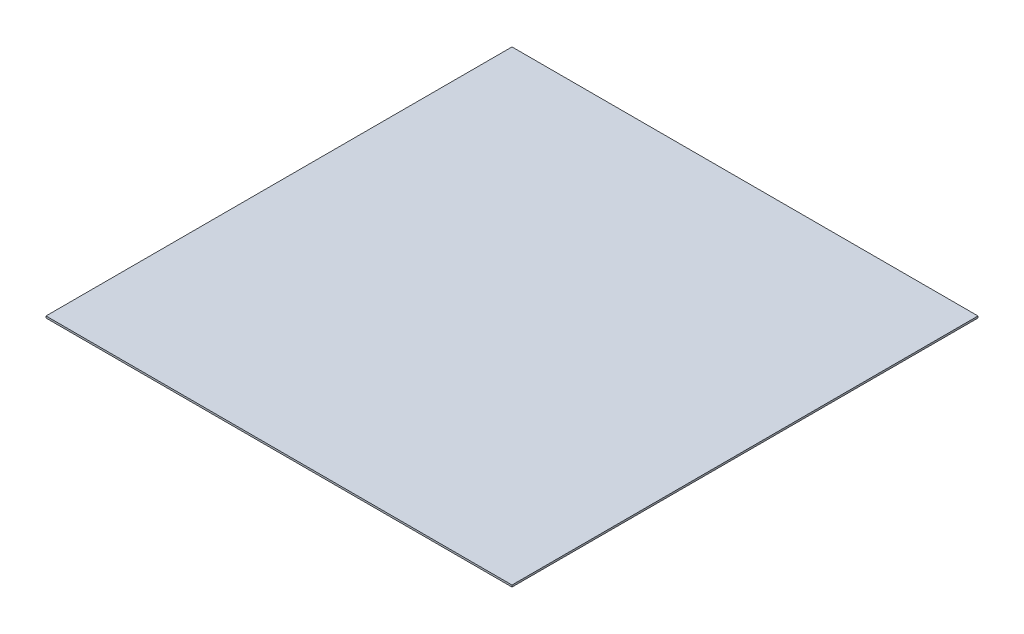
ISO-10303-21;
HEADER;
FILE_DESCRIPTION(('STEP AP214'),'2;1');
FILE_NAME('part.step','',(''),(''),'','','');
FILE_SCHEMA(('AUTOMOTIVE_DESIGN { 1 0 10303 214 1 1 1 1 }'));
ENDSEC;
DATA;
#1=APPLICATION_CONTEXT('core data for automotive mechanical design processes');
#2=APPLICATION_PROTOCOL_DEFINITION('international standard','automotive_design',2000,#1);
#3=PRODUCT_CONTEXT('',#1,'mechanical');
#4=PRODUCT('Part','Part','',(#3));
#5=PRODUCT_RELATED_PRODUCT_CATEGORY('part','',(#4));
#6=PRODUCT_DEFINITION_FORMATION('','',#4);
#7=PRODUCT_DEFINITION_CONTEXT('part definition',#1,'design');
#8=PRODUCT_DEFINITION('design','',#6,#7);
#9=PRODUCT_DEFINITION_SHAPE('','',#8);
#10=(LENGTH_UNIT() NAMED_UNIT(*) SI_UNIT(.MILLI.,.METRE.));
#11=(NAMED_UNIT(*) PLANE_ANGLE_UNIT() SI_UNIT($,.RADIAN.));
#12=(NAMED_UNIT(*) SI_UNIT($,.STERADIAN.) SOLID_ANGLE_UNIT());
#13=UNCERTAINTY_MEASURE_WITH_UNIT(LENGTH_MEASURE(1.E-05),#10,'distance_accuracy_value','');
#14=(GEOMETRIC_REPRESENTATION_CONTEXT(3) GLOBAL_UNCERTAINTY_ASSIGNED_CONTEXT((#13)) GLOBAL_UNIT_ASSIGNED_CONTEXT((#10,
#11,#12)) REPRESENTATION_CONTEXT('',''));
#15=CARTESIAN_POINT('',(0.,0.,0.));
#16=DIRECTION('',(0.,0.,1.));
#17=DIRECTION('',(1.,0.,0.));
#18=AXIS2_PLACEMENT_3D('',#15,#16,#17);
#19=CARTESIAN_POINT('',(255.,2.,255.));
#20=DIRECTION('',(-1.,0.,0.));
#21=DIRECTION('',(0.,0.,1.));
#22=AXIS2_PLACEMENT_3D('',#19,#20,#21);
#23=PLANE('',#22);
#24=DIRECTION('',(0.,0.,-1.));
#25=VECTOR('',#24,1.);
#26=CARTESIAN_POINT('',(255.,0.,255.));
#27=LINE('',#26,#25);
#28=CARTESIAN_POINT('',(255.,0.,255.));
#29=VERTEX_POINT('',#28);
#30=CARTESIAN_POINT('',(255.,0.,-255.));
#31=VERTEX_POINT('',#30);
#32=EDGE_CURVE('E96',#29,#31,#27,.T.);
#33=ORIENTED_EDGE('',*,*,#32,.T.);
#34=DIRECTION('',(0.,-1.,0.));
#35=VECTOR('',#34,1.);
#36=CARTESIAN_POINT('',(255.,2.,-255.));
#37=LINE('',#36,#35);
#38=CARTESIAN_POINT('',(255.,2.,-255.));
#39=VERTEX_POINT('',#38);
#40=EDGE_CURVE('E11',#39,#31,#37,.T.);
#41=ORIENTED_EDGE('',*,*,#40,.F.);
#42=DIRECTION('',(0.,0.,-1.));
#43=VECTOR('',#42,1.);
#44=CARTESIAN_POINT('',(255.,2.,255.));
#45=LINE('',#44,#43);
#46=CARTESIAN_POINT('',(255.,2.,255.));
#47=VERTEX_POINT('',#46);
#48=EDGE_CURVE('E84',#47,#39,#45,.T.);
#49=ORIENTED_EDGE('',*,*,#48,.F.);
#50=DIRECTION('',(0.,-1.,0.));
#51=VECTOR('',#50,1.);
#52=CARTESIAN_POINT('',(255.,2.,255.));
#53=LINE('',#52,#51);
#54=EDGE_CURVE('E92',#47,#29,#53,.T.);
#55=ORIENTED_EDGE('',*,*,#54,.T.);
#56=EDGE_LOOP('',(#33,#41,#49,#55));
#57=FACE_BOUND('',#56,.T.);
#58=ADVANCED_FACE('F33',(#57),#23,.F.);
#59=CARTESIAN_POINT('',(-255.,2.,-255.));
#60=DIRECTION('',(0.,0.,1.));
#61=DIRECTION('',(1.,0.,0.));
#62=AXIS2_PLACEMENT_3D('',#59,#60,#61);
#63=PLANE('',#62);
#64=DIRECTION('',(-1.,0.,0.));
#65=VECTOR('',#64,1.);
#66=CARTESIAN_POINT('',(-255.,0.,-255.));
#67=LINE('',#66,#65);
#68=CARTESIAN_POINT('',(-255.,0.,-255.));
#69=VERTEX_POINT('',#68);
#70=EDGE_CURVE('E88',#31,#69,#67,.T.);
#71=ORIENTED_EDGE('',*,*,#70,.T.);
#72=DIRECTION('',(0.,-1.,0.));
#73=VECTOR('',#72,1.);
#74=CARTESIAN_POINT('',(-255.,2.,-255.));
#75=LINE('',#74,#73);
#76=CARTESIAN_POINT('',(-255.,2.,-255.));
#77=VERTEX_POINT('',#76);
#78=EDGE_CURVE('E41',#77,#69,#75,.T.);
#79=ORIENTED_EDGE('',*,*,#78,.F.);
#80=DIRECTION('',(-1.,0.,0.));
#81=VECTOR('',#80,1.);
#82=CARTESIAN_POINT('',(-255.,2.,-255.));
#83=LINE('',#82,#81);
#84=EDGE_CURVE('E79',#39,#77,#83,.T.);
#85=ORIENTED_EDGE('',*,*,#84,.F.);
#86=ORIENTED_EDGE('',*,*,#40,.T.);
#87=EDGE_LOOP('',(#71,#79,#85,#86));
#88=FACE_BOUND('',#87,.T.);
#89=ADVANCED_FACE('F87',(#88),#63,.F.);
#90=CARTESIAN_POINT('',(-255.,2.,255.));
#91=DIRECTION('',(1.,0.,0.));
#92=DIRECTION('',(0.,0.,-1.));
#93=AXIS2_PLACEMENT_3D('',#90,#91,#92);
#94=PLANE('',#93);
#95=DIRECTION('',(0.,0.,1.));
#96=VECTOR('',#95,1.);
#97=CARTESIAN_POINT('',(-255.,0.,255.));
#98=LINE('',#97,#96);
#99=CARTESIAN_POINT('',(-255.,0.,255.));
#100=VERTEX_POINT('',#99);
#101=EDGE_CURVE('E66',#69,#100,#98,.T.);
#102=ORIENTED_EDGE('',*,*,#101,.T.);
#103=DIRECTION('',(0.,-1.,0.));
#104=VECTOR('',#103,1.);
#105=CARTESIAN_POINT('',(-255.,2.,255.));
#106=LINE('',#105,#104);
#107=CARTESIAN_POINT('',(-255.,2.,255.));
#108=VERTEX_POINT('',#107);
#109=EDGE_CURVE('E89',#108,#100,#106,.T.);
#110=ORIENTED_EDGE('',*,*,#109,.F.);
#111=DIRECTION('',(0.,0.,1.));
#112=VECTOR('',#111,1.);
#113=CARTESIAN_POINT('',(-255.,2.,255.));
#114=LINE('',#113,#112);
#115=EDGE_CURVE('E82',#77,#108,#114,.T.);
#116=ORIENTED_EDGE('',*,*,#115,.F.);
#117=ORIENTED_EDGE('',*,*,#78,.T.);
#118=EDGE_LOOP('',(#102,#110,#116,#117));
#119=FACE_BOUND('',#118,.T.);
#120=ADVANCED_FACE('F90',(#119),#94,.F.);
#121=CARTESIAN_POINT('',(-255.,2.,255.));
#122=DIRECTION('',(0.,0.,-1.));
#123=DIRECTION('',(-1.,0.,0.));
#124=AXIS2_PLACEMENT_3D('',#121,#122,#123);
#125=PLANE('',#124);
#126=DIRECTION('',(1.,0.,0.));
#127=VECTOR('',#126,1.);
#128=CARTESIAN_POINT('',(-255.,0.,255.));
#129=LINE('',#128,#127);
#130=EDGE_CURVE('E72',#100,#29,#129,.T.);
#131=ORIENTED_EDGE('',*,*,#130,.T.);
#132=ORIENTED_EDGE('',*,*,#54,.F.);
#133=DIRECTION('',(1.,0.,0.));
#134=VECTOR('',#133,1.);
#135=CARTESIAN_POINT('',(-255.,2.,255.));
#136=LINE('',#135,#134);
#137=EDGE_CURVE('E49',#108,#47,#136,.T.);
#138=ORIENTED_EDGE('',*,*,#137,.F.);
#139=ORIENTED_EDGE('',*,*,#109,.T.);
#140=EDGE_LOOP('',(#131,#132,#138,#139));
#141=FACE_BOUND('',#140,.T.);
#142=ADVANCED_FACE('F103',(#141),#125,.F.);
#143=CARTESIAN_POINT('',(0.,2.,0.));
#144=DIRECTION('',(0.,-1.,0.));
#145=DIRECTION('',(0.,0.,-1.));
#146=AXIS2_PLACEMENT_3D('',#143,#144,#145);
#147=PLANE('',#146);
#148=ORIENTED_EDGE('',*,*,#48,.T.);
#149=ORIENTED_EDGE('',*,*,#84,.T.);
#150=ORIENTED_EDGE('',*,*,#115,.T.);
#151=ORIENTED_EDGE('',*,*,#137,.T.);
#152=EDGE_LOOP('',(#148,#149,#150,#151));
#153=FACE_BOUND('',#152,.T.);
#154=ADVANCED_FACE('F80',(#153),#147,.F.);
#155=CARTESIAN_POINT('',(0.,0.,0.));
#156=DIRECTION('',(0.,-1.,0.));
#157=DIRECTION('',(0.,0.,-1.));
#158=AXIS2_PLACEMENT_3D('',#155,#156,#157);
#159=PLANE('',#158);
#160=ORIENTED_EDGE('',*,*,#32,.F.);
#161=ORIENTED_EDGE('',*,*,#130,.F.);
#162=ORIENTED_EDGE('',*,*,#101,.F.);
#163=ORIENTED_EDGE('',*,*,#70,.F.);
#164=EDGE_LOOP('',(#160,#161,#162,#163));
#165=FACE_BOUND('',#164,.T.);
#166=ADVANCED_FACE('F106',(#165),#159,.T.);
#167=CLOSED_SHELL('',(#58,#89,#120,#142,#154,#166));
#168=MANIFOLD_SOLID_BREP('B2',#167);
#169=ADVANCED_BREP_SHAPE_REPRESENTATION('',(#18,#168),#14);
#170=SHAPE_DEFINITION_REPRESENTATION(#9,#169);
ENDSEC;
END-ISO-10303-21;
